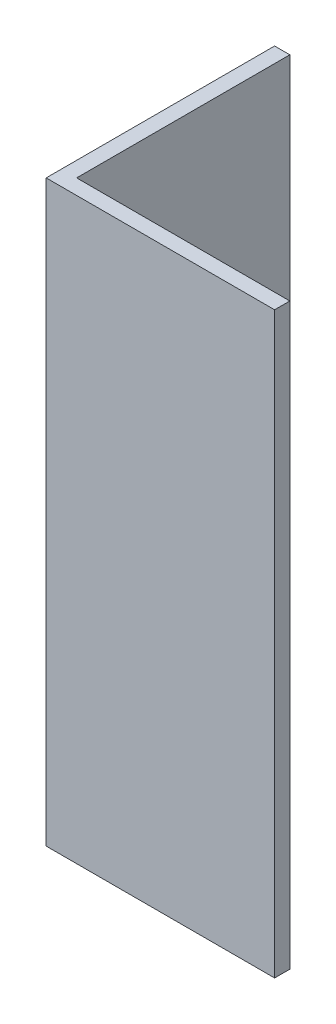
ISO-10303-21;
HEADER;
FILE_DESCRIPTION(('STEP AP214'),'2;1');
FILE_NAME('part.step','',(''),(''),'','','');
FILE_SCHEMA(('AUTOMOTIVE_DESIGN { 1 0 10303 214 1 1 1 1 }'));
ENDSEC;
DATA;
#1=APPLICATION_CONTEXT('core data for automotive mechanical design processes');
#2=APPLICATION_PROTOCOL_DEFINITION('international standard','automotive_design',2000,#1);
#3=PRODUCT_CONTEXT('',#1,'mechanical');
#4=PRODUCT('Part','Part','',(#3));
#5=PRODUCT_RELATED_PRODUCT_CATEGORY('part','',(#4));
#6=PRODUCT_DEFINITION_FORMATION('','',#4);
#7=PRODUCT_DEFINITION_CONTEXT('part definition',#1,'design');
#8=PRODUCT_DEFINITION('design','',#6,#7);
#9=PRODUCT_DEFINITION_SHAPE('','',#8);
#10=(LENGTH_UNIT() NAMED_UNIT(*) SI_UNIT(.MILLI.,.METRE.));
#11=(NAMED_UNIT(*) PLANE_ANGLE_UNIT() SI_UNIT($,.RADIAN.));
#12=(NAMED_UNIT(*) SI_UNIT($,.STERADIAN.) SOLID_ANGLE_UNIT());
#13=UNCERTAINTY_MEASURE_WITH_UNIT(LENGTH_MEASURE(1.E-05),#10,'distance_accuracy_value','');
#14=(GEOMETRIC_REPRESENTATION_CONTEXT(3) GLOBAL_UNCERTAINTY_ASSIGNED_CONTEXT((#13)) GLOBAL_UNIT_ASSIGNED_CONTEXT((#10,
#11,#12)) REPRESENTATION_CONTEXT('',''));
#15=CARTESIAN_POINT('',(0.,0.,0.));
#16=DIRECTION('',(0.,0.,1.));
#17=DIRECTION('',(1.,0.,0.));
#18=AXIS2_PLACEMENT_3D('',#15,#16,#17);
#19=CARTESIAN_POINT('',(15.,38.,0.));
#20=DIRECTION('',(0.,0.,-1.));
#21=DIRECTION('',(-1.,0.,0.));
#22=AXIS2_PLACEMENT_3D('',#19,#20,#21);
#23=PLANE('',#22);
#24=DIRECTION('',(1.,0.,0.));
#25=VECTOR('',#24,1.);
#26=CARTESIAN_POINT('',(15.,0.,0.));
#27=LINE('',#26,#25);
#28=CARTESIAN_POINT('',(0.,0.,0.));
#29=VERTEX_POINT('',#28);
#30=CARTESIAN_POINT('',(15.,0.,0.));
#31=VERTEX_POINT('',#30);
#32=EDGE_CURVE('E117',#29,#31,#27,.T.);
#33=ORIENTED_EDGE('',*,*,#32,.T.);
#34=DIRECTION('',(0.,-1.,0.));
#35=VECTOR('',#34,1.);
#36=CARTESIAN_POINT('',(15.,38.,0.));
#37=LINE('',#36,#35);
#38=CARTESIAN_POINT('',(15.,38.,0.));
#39=VERTEX_POINT('',#38);
#40=EDGE_CURVE('E11',#39,#31,#37,.T.);
#41=ORIENTED_EDGE('',*,*,#40,.F.);
#42=DIRECTION('',(1.,0.,0.));
#43=VECTOR('',#42,1.);
#44=CARTESIAN_POINT('',(15.,38.,0.));
#45=LINE('',#44,#43);
#46=CARTESIAN_POINT('',(0.,38.,0.));
#47=VERTEX_POINT('',#46);
#48=EDGE_CURVE('E127',#47,#39,#45,.T.);
#49=ORIENTED_EDGE('',*,*,#48,.F.);
#50=DIRECTION('',(0.,-1.,0.));
#51=VECTOR('',#50,1.);
#52=CARTESIAN_POINT('',(0.,38.,0.));
#53=LINE('',#52,#51);
#54=EDGE_CURVE('E113',#47,#29,#53,.T.);
#55=ORIENTED_EDGE('',*,*,#54,.T.);
#56=EDGE_LOOP('',(#33,#41,#49,#55));
#57=FACE_BOUND('',#56,.T.);
#58=ADVANCED_FACE('F33',(#57),#23,.F.);
#59=CARTESIAN_POINT('',(15.,38.,-0.999999999999998));
#60=DIRECTION('',(-1.,0.,0.));
#61=DIRECTION('',(0.,0.,1.));
#62=AXIS2_PLACEMENT_3D('',#59,#60,#61);
#63=PLANE('',#62);
#64=DIRECTION('',(0.,0.,-1.));
#65=VECTOR('',#64,1.);
#66=CARTESIAN_POINT('',(15.,0.,-0.999999999999998));
#67=LINE('',#66,#65);
#68=CARTESIAN_POINT('',(15.,0.,-0.999999999999998));
#69=VERTEX_POINT('',#68);
#70=EDGE_CURVE('E120',#31,#69,#67,.T.);
#71=ORIENTED_EDGE('',*,*,#70,.T.);
#72=DIRECTION('',(0.,-1.,0.));
#73=VECTOR('',#72,1.);
#74=CARTESIAN_POINT('',(15.,38.,-0.999999999999998));
#75=LINE('',#74,#73);
#76=CARTESIAN_POINT('',(15.,38.,-0.999999999999998));
#77=VERTEX_POINT('',#76);
#78=EDGE_CURVE('E41',#77,#69,#75,.T.);
#79=ORIENTED_EDGE('',*,*,#78,.F.);
#80=DIRECTION('',(0.,0.,-1.));
#81=VECTOR('',#80,1.);
#82=CARTESIAN_POINT('',(15.,38.,-0.999999999999998));
#83=LINE('',#82,#81);
#84=EDGE_CURVE('E86',#39,#77,#83,.T.);
#85=ORIENTED_EDGE('',*,*,#84,.F.);
#86=ORIENTED_EDGE('',*,*,#40,.T.);
#87=EDGE_LOOP('',(#71,#79,#85,#86));
#88=FACE_BOUND('',#87,.T.);
#89=ADVANCED_FACE('F151',(#88),#63,.F.);
#90=CARTESIAN_POINT('',(1.,38.,-0.999999999999997));
#91=DIRECTION('',(0.,0.,1.));
#92=DIRECTION('',(1.,0.,0.));
#93=AXIS2_PLACEMENT_3D('',#90,#91,#92);
#94=PLANE('',#93);
#95=DIRECTION('',(-1.,0.,0.));
#96=VECTOR('',#95,1.);
#97=CARTESIAN_POINT('',(1.,0.,-0.999999999999997));
#98=LINE('',#97,#96);
#99=CARTESIAN_POINT('',(1.,0.,-0.999999999999997));
#100=VERTEX_POINT('',#99);
#101=EDGE_CURVE('E122',#69,#100,#98,.T.);
#102=ORIENTED_EDGE('',*,*,#101,.T.);
#103=DIRECTION('',(0.,-1.,0.));
#104=VECTOR('',#103,1.);
#105=CARTESIAN_POINT('',(1.,38.,-0.999999999999997));
#106=LINE('',#105,#104);
#107=CARTESIAN_POINT('',(1.,38.,-0.999999999999997));
#108=VERTEX_POINT('',#107);
#109=EDGE_CURVE('E108',#108,#100,#106,.T.);
#110=ORIENTED_EDGE('',*,*,#109,.F.);
#111=DIRECTION('',(-1.,0.,0.));
#112=VECTOR('',#111,1.);
#113=CARTESIAN_POINT('',(1.,38.,-0.999999999999997));
#114=LINE('',#113,#112);
#115=EDGE_CURVE('E99',#77,#108,#114,.T.);
#116=ORIENTED_EDGE('',*,*,#115,.F.);
#117=ORIENTED_EDGE('',*,*,#78,.T.);
#118=EDGE_LOOP('',(#102,#110,#116,#117));
#119=FACE_BOUND('',#118,.T.);
#120=ADVANCED_FACE('F133',(#119),#94,.F.);
#121=CARTESIAN_POINT('',(0.999999999999998,38.,-15.));
#122=DIRECTION('',(-1.,0.,0.));
#123=DIRECTION('',(0.,0.,1.));
#124=AXIS2_PLACEMENT_3D('',#121,#122,#123);
#125=PLANE('',#124);
#126=DIRECTION('',(0.,0.,-1.));
#127=VECTOR('',#126,1.);
#128=CARTESIAN_POINT('',(0.999999999999998,0.,-15.));
#129=LINE('',#128,#127);
#130=CARTESIAN_POINT('',(0.999999999999998,0.,-15.));
#131=VERTEX_POINT('',#130);
#132=EDGE_CURVE('E107',#100,#131,#129,.T.);
#133=ORIENTED_EDGE('',*,*,#132,.T.);
#134=DIRECTION('',(0.,-1.,0.));
#135=VECTOR('',#134,1.);
#136=CARTESIAN_POINT('',(0.999999999999998,38.,-15.));
#137=LINE('',#136,#135);
#138=CARTESIAN_POINT('',(0.999999999999998,38.,-15.));
#139=VERTEX_POINT('',#138);
#140=EDGE_CURVE('E104',#139,#131,#137,.T.);
#141=ORIENTED_EDGE('',*,*,#140,.F.);
#142=DIRECTION('',(0.,0.,-1.));
#143=VECTOR('',#142,1.);
#144=CARTESIAN_POINT('',(0.999999999999998,38.,-15.));
#145=LINE('',#144,#143);
#146=EDGE_CURVE('E93',#108,#139,#145,.T.);
#147=ORIENTED_EDGE('',*,*,#146,.F.);
#148=ORIENTED_EDGE('',*,*,#109,.T.);
#149=EDGE_LOOP('',(#133,#141,#147,#148));
#150=FACE_BOUND('',#149,.T.);
#151=ADVANCED_FACE('F105',(#150),#125,.F.);
#152=CARTESIAN_POINT('',(0.,38.,-15.));
#153=DIRECTION('',(0.,0.,1.));
#154=DIRECTION('',(1.,0.,0.));
#155=AXIS2_PLACEMENT_3D('',#152,#153,#154);
#156=PLANE('',#155);
#157=DIRECTION('',(-1.,0.,0.));
#158=VECTOR('',#157,1.);
#159=CARTESIAN_POINT('',(0.,0.,-15.));
#160=LINE('',#159,#158);
#161=CARTESIAN_POINT('',(0.,0.,-15.));
#162=VERTEX_POINT('',#161);
#163=EDGE_CURVE('E72',#131,#162,#160,.T.);
#164=ORIENTED_EDGE('',*,*,#163,.T.);
#165=DIRECTION('',(0.,-1.,0.));
#166=VECTOR('',#165,1.);
#167=CARTESIAN_POINT('',(0.,38.,-15.));
#168=LINE('',#167,#166);
#169=CARTESIAN_POINT('',(0.,38.,-15.));
#170=VERTEX_POINT('',#169);
#171=EDGE_CURVE('E109',#170,#162,#168,.T.);
#172=ORIENTED_EDGE('',*,*,#171,.F.);
#173=DIRECTION('',(-1.,0.,0.));
#174=VECTOR('',#173,1.);
#175=CARTESIAN_POINT('',(0.,38.,-15.));
#176=LINE('',#175,#174);
#177=EDGE_CURVE('E97',#139,#170,#176,.T.);
#178=ORIENTED_EDGE('',*,*,#177,.F.);
#179=ORIENTED_EDGE('',*,*,#140,.T.);
#180=EDGE_LOOP('',(#164,#172,#178,#179));
#181=FACE_BOUND('',#180,.T.);
#182=ADVANCED_FACE('F111',(#181),#156,.F.);
#183=CARTESIAN_POINT('',(0.,38.,0.));
#184=DIRECTION('',(1.,0.,0.));
#185=DIRECTION('',(0.,0.,-1.));
#186=AXIS2_PLACEMENT_3D('',#183,#184,#185);
#187=PLANE('',#186);
#188=DIRECTION('',(0.,0.,1.));
#189=VECTOR('',#188,1.);
#190=CARTESIAN_POINT('',(0.,0.,0.));
#191=LINE('',#190,#189);
#192=EDGE_CURVE('E78',#162,#29,#191,.T.);
#193=ORIENTED_EDGE('',*,*,#192,.T.);
#194=ORIENTED_EDGE('',*,*,#54,.F.);
#195=DIRECTION('',(0.,0.,1.));
#196=VECTOR('',#195,1.);
#197=CARTESIAN_POINT('',(0.,38.,0.));
#198=LINE('',#197,#196);
#199=EDGE_CURVE('E49',#170,#47,#198,.T.);
#200=ORIENTED_EDGE('',*,*,#199,.F.);
#201=ORIENTED_EDGE('',*,*,#171,.T.);
#202=EDGE_LOOP('',(#193,#194,#200,#201));
#203=FACE_BOUND('',#202,.T.);
#204=ADVANCED_FACE('F140',(#203),#187,.F.);
#205=CARTESIAN_POINT('',(0.,38.,0.));
#206=DIRECTION('',(0.,-1.,0.));
#207=DIRECTION('',(0.,0.,-1.));
#208=AXIS2_PLACEMENT_3D('',#205,#206,#207);
#209=PLANE('',#208);
#210=ORIENTED_EDGE('',*,*,#48,.T.);
#211=ORIENTED_EDGE('',*,*,#84,.T.);
#212=ORIENTED_EDGE('',*,*,#115,.T.);
#213=ORIENTED_EDGE('',*,*,#146,.T.);
#214=ORIENTED_EDGE('',*,*,#177,.T.);
#215=ORIENTED_EDGE('',*,*,#199,.T.);
#216=EDGE_LOOP('',(#210,#211,#212,#213,#214,#215));
#217=FACE_BOUND('',#216,.T.);
#218=ADVANCED_FACE('F95',(#217),#209,.F.);
#219=CARTESIAN_POINT('',(0.,0.,0.));
#220=DIRECTION('',(0.,-1.,0.));
#221=DIRECTION('',(0.,0.,-1.));
#222=AXIS2_PLACEMENT_3D('',#219,#220,#221);
#223=PLANE('',#222);
#224=ORIENTED_EDGE('',*,*,#32,.F.);
#225=ORIENTED_EDGE('',*,*,#192,.F.);
#226=ORIENTED_EDGE('',*,*,#163,.F.);
#227=ORIENTED_EDGE('',*,*,#132,.F.);
#228=ORIENTED_EDGE('',*,*,#101,.F.);
#229=ORIENTED_EDGE('',*,*,#70,.F.);
#230=EDGE_LOOP('',(#224,#225,#226,#227,#228,#229));
#231=FACE_BOUND('',#230,.T.);
#232=ADVANCED_FACE('F136',(#231),#223,.T.);
#233=CLOSED_SHELL('',(#58,#89,#120,#151,#182,#204,#218,#232));
#234=MANIFOLD_SOLID_BREP('B2',#233);
#235=ADVANCED_BREP_SHAPE_REPRESENTATION('',(#18,#234),#14);
#236=SHAPE_DEFINITION_REPRESENTATION(#9,#235);
ENDSEC;
END-ISO-10303-21;
